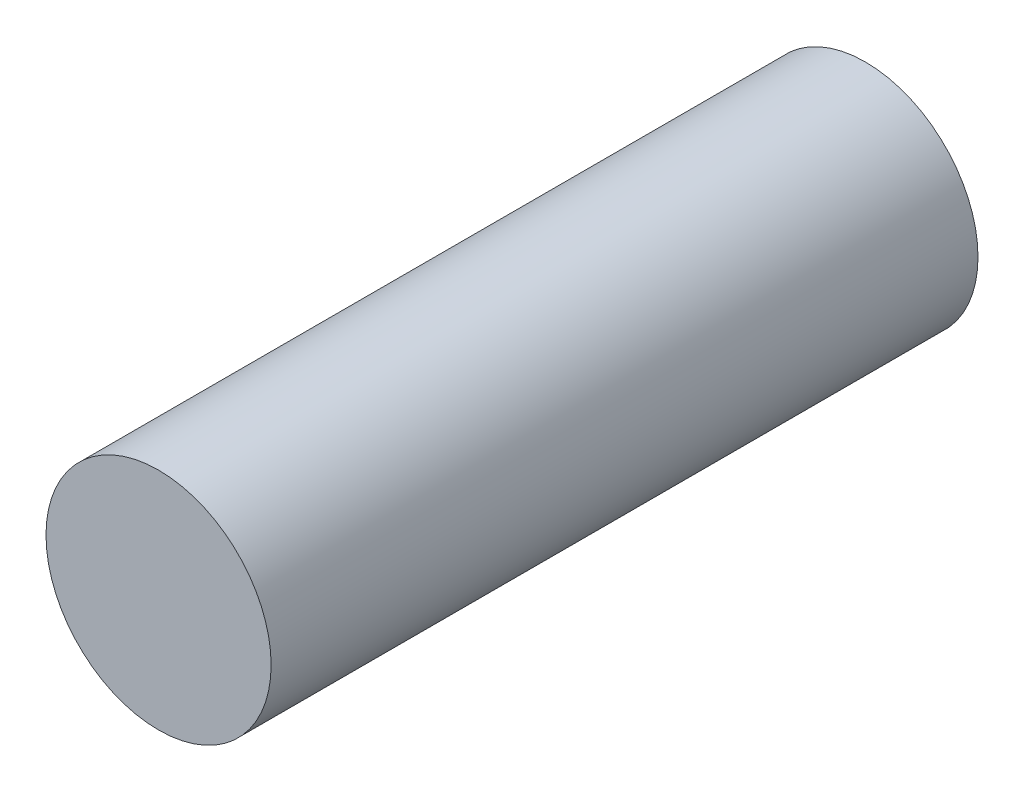
ISO-10303-21;
HEADER;
FILE_DESCRIPTION(('STEP AP214'),'2;1');
FILE_NAME('part.step','',(''),(''),'','','');
FILE_SCHEMA(('AUTOMOTIVE_DESIGN { 1 0 10303 214 1 1 1 1 }'));
ENDSEC;
DATA;
#1=APPLICATION_CONTEXT('core data for automotive mechanical design processes');
#2=APPLICATION_PROTOCOL_DEFINITION('international standard','automotive_design',2000,#1);
#3=PRODUCT_CONTEXT('',#1,'mechanical');
#4=PRODUCT('Part','Part','',(#3));
#5=PRODUCT_RELATED_PRODUCT_CATEGORY('part','',(#4));
#6=PRODUCT_DEFINITION_FORMATION('','',#4);
#7=PRODUCT_DEFINITION_CONTEXT('part definition',#1,'design');
#8=PRODUCT_DEFINITION('design','',#6,#7);
#9=PRODUCT_DEFINITION_SHAPE('','',#8);
#10=(LENGTH_UNIT() NAMED_UNIT(*) SI_UNIT(.MILLI.,.METRE.));
#11=(NAMED_UNIT(*) PLANE_ANGLE_UNIT() SI_UNIT($,.RADIAN.));
#12=(NAMED_UNIT(*) SI_UNIT($,.STERADIAN.) SOLID_ANGLE_UNIT());
#13=UNCERTAINTY_MEASURE_WITH_UNIT(LENGTH_MEASURE(1.E-05),#10,'distance_accuracy_value','');
#14=(GEOMETRIC_REPRESENTATION_CONTEXT(3) GLOBAL_UNCERTAINTY_ASSIGNED_CONTEXT((#13)) GLOBAL_UNIT_ASSIGNED_CONTEXT((#10,
#11,#12)) REPRESENTATION_CONTEXT('',''));
#15=CARTESIAN_POINT('',(0.,0.,0.));
#16=DIRECTION('',(0.,0.,1.));
#17=DIRECTION('',(1.,0.,0.));
#18=AXIS2_PLACEMENT_3D('',#15,#16,#17);
#19=CARTESIAN_POINT('',(0.,0.,3140.));
#20=DIRECTION('',(0.,0.,-1.));
#21=DIRECTION('',(-1.,0.,0.));
#22=AXIS2_PLACEMENT_3D('',#19,#20,#21);
#23=CYLINDRICAL_SURFACE('',#22,500.);
#24=CARTESIAN_POINT('',(0.,0.,3140.));
#25=DIRECTION('',(0.,0.,1.));
#26=DIRECTION('',(1.,0.,0.));
#27=AXIS2_PLACEMENT_3D('',#24,#25,#26);
#28=CIRCLE('',#27,500.);
#29=CARTESIAN_POINT('',(500.,0.,3140.));
#30=VERTEX_POINT('',#29);
#31=EDGE_CURVE('E10',#30,#30,#28,.T.);
#32=ORIENTED_EDGE('',*,*,#31,.F.);
#33=EDGE_LOOP('',(#32));
#34=FACE_BOUND('',#33,.T.);
#35=CARTESIAN_POINT('',(0.,0.,0.));
#36=DIRECTION('',(0.,0.,1.));
#37=DIRECTION('',(1.,0.,0.));
#38=AXIS2_PLACEMENT_3D('',#35,#36,#37);
#39=CIRCLE('',#38,500.);
#40=CARTESIAN_POINT('',(500.,0.,0.));
#41=VERTEX_POINT('',#40);
#42=EDGE_CURVE('E34',#41,#41,#39,.T.);
#43=ORIENTED_EDGE('',*,*,#42,.T.);
#44=EDGE_LOOP('',(#43));
#45=FACE_BOUND('',#44,.T.);
#46=ADVANCED_FACE('F31',(#34,#45),#23,.T.);
#47=CARTESIAN_POINT('',(0.,0.,3140.));
#48=DIRECTION('',(0.,0.,1.));
#49=DIRECTION('',(1.,0.,0.));
#50=AXIS2_PLACEMENT_3D('',#47,#48,#49);
#51=PLANE('',#50);
#52=ORIENTED_EDGE('',*,*,#31,.T.);
#53=EDGE_LOOP('',(#52));
#54=FACE_BOUND('',#53,.T.);
#55=ADVANCED_FACE('F46',(#54),#51,.T.);
#56=CARTESIAN_POINT('',(0.,0.,0.));
#57=DIRECTION('',(0.,0.,1.));
#58=DIRECTION('',(1.,0.,0.));
#59=AXIS2_PLACEMENT_3D('',#56,#57,#58);
#60=PLANE('',#59);
#61=ORIENTED_EDGE('',*,*,#42,.F.);
#62=EDGE_LOOP('',(#61));
#63=FACE_BOUND('',#62,.T.);
#64=ADVANCED_FACE('F44',(#63),#60,.F.);
#65=CLOSED_SHELL('',(#46,#55,#64));
#66=MANIFOLD_SOLID_BREP('B2',#65);
#67=ADVANCED_BREP_SHAPE_REPRESENTATION('',(#18,#66),#14);
#68=SHAPE_DEFINITION_REPRESENTATION(#9,#67);
ENDSEC;
END-ISO-10303-21;
